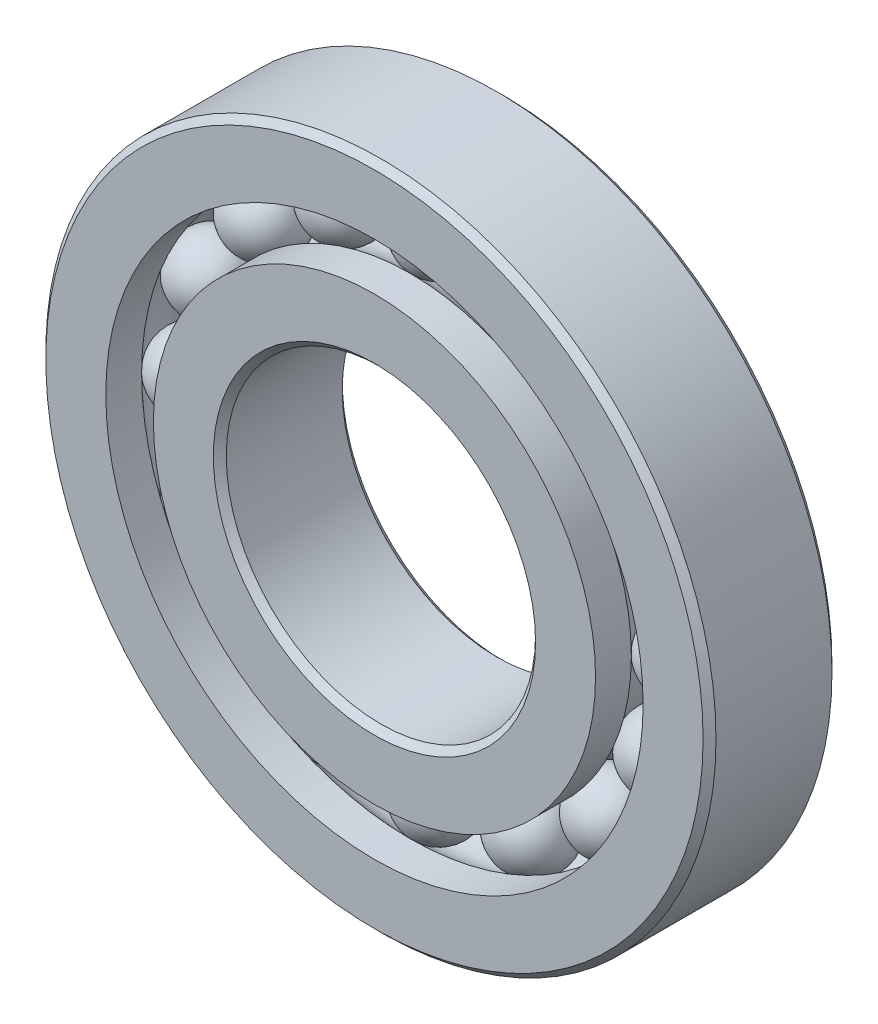
ISO-10303-21;
HEADER;
FILE_DESCRIPTION(('STEP AP214'),'2;1');
FILE_NAME('part.step','',(''),(''),'','','');
FILE_SCHEMA(('AUTOMOTIVE_DESIGN { 1 0 10303 214 1 1 1 1 }'));
ENDSEC;
DATA;
#1=APPLICATION_CONTEXT('core data for automotive mechanical design processes');
#2=APPLICATION_PROTOCOL_DEFINITION('international standard','automotive_design',2000,#1);
#3=PRODUCT_CONTEXT('',#1,'mechanical');
#4=PRODUCT('Part','Part','',(#3));
#5=PRODUCT_RELATED_PRODUCT_CATEGORY('part','',(#4));
#6=PRODUCT_DEFINITION_FORMATION('','',#4);
#7=PRODUCT_DEFINITION_CONTEXT('part definition',#1,'design');
#8=PRODUCT_DEFINITION('design','',#6,#7);
#9=PRODUCT_DEFINITION_SHAPE('','',#8);
#10=(LENGTH_UNIT() NAMED_UNIT(*) SI_UNIT(.MILLI.,.METRE.));
#11=(NAMED_UNIT(*) PLANE_ANGLE_UNIT() SI_UNIT($,.RADIAN.));
#12=(NAMED_UNIT(*) SI_UNIT($,.STERADIAN.) SOLID_ANGLE_UNIT());
#13=UNCERTAINTY_MEASURE_WITH_UNIT(LENGTH_MEASURE(1.E-05),#10,'distance_accuracy_value','');
#14=(GEOMETRIC_REPRESENTATION_CONTEXT(3) GLOBAL_UNCERTAINTY_ASSIGNED_CONTEXT((#13)) GLOBAL_UNIT_ASSIGNED_CONTEXT((#10,
#11,#12)) REPRESENTATION_CONTEXT('',''));
#15=CARTESIAN_POINT('',(0.,0.,0.));
#16=DIRECTION('',(0.,0.,1.));
#17=DIRECTION('',(1.,0.,0.));
#18=AXIS2_PLACEMENT_3D('',#15,#16,#17);
#19=CARTESIAN_POINT('',(-5.77134451435582,13.9332581996859,0.));
#20=DIRECTION('',(0.,0.,1.));
#21=DIRECTION('',(-0.382683432365077,0.923879532511292,0.));
#22=AXIS2_PLACEMENT_3D('',#19,#20,#21);
#23=SPHERICAL_SURFACE('',#22,2.29317598176668);
#24=CARTESIAN_POINT('',(-5.77134451435582,13.9332581996859,2.29317598176668));
#25=VERTEX_POINT('',#24);
#26=VERTEX_LOOP('',#25);
#27=FACE_BOUND('',#26,.T.);
#28=ADVANCED_FACE('F41',(#27),#23,.T.);
#29=CLOSED_SHELL('',(#28));
#30=MANIFOLD_SOLID_BREP('B2',#29);
#31=CARTESIAN_POINT('',(-10.6640541437695,10.6640541437698,0.));
#32=DIRECTION('',(0.,0.,1.));
#33=DIRECTION('',(-0.707106781186539,0.707106781186556,0.));
#34=AXIS2_PLACEMENT_3D('',#31,#32,#33);
#35=SPHERICAL_SURFACE('',#34,2.29317598176668);
#36=CARTESIAN_POINT('',(-10.6640541437695,10.6640541437698,2.29317598176668));
#37=VERTEX_POINT('',#36);
#38=VERTEX_LOOP('',#37);
#39=FACE_BOUND('',#38,.T.);
#40=ADVANCED_FACE('F74',(#39),#35,.T.);
#41=CLOSED_SHELL('',(#40));
#42=MANIFOLD_SOLID_BREP('B6',#41);
#43=CARTESIAN_POINT('',(-13.9332581996858,5.77134451435616,0.));
#44=DIRECTION('',(0.,0.,1.));
#45=DIRECTION('',(-0.923879532511283,0.3826834323651,0.));
#46=AXIS2_PLACEMENT_3D('',#43,#44,#45);
#47=SPHERICAL_SURFACE('',#46,2.29317598176668);
#48=CARTESIAN_POINT('',(-13.9332581996858,5.77134451435616,2.29317598176668));
#49=VERTEX_POINT('',#48);
#50=VERTEX_LOOP('',#49);
#51=FACE_BOUND('',#50,.T.);
#52=ADVANCED_FACE('F105',(#51),#47,.T.);
#53=CLOSED_SHELL('',(#52));
#54=MANIFOLD_SOLID_BREP('B37',#53);
#55=CARTESIAN_POINT('',(-15.08125,1.57967800319193E-13,0.));
#56=DIRECTION('',(0.,0.,1.));
#57=DIRECTION('',(-1.,0.,0.));
#58=AXIS2_PLACEMENT_3D('',#55,#56,#57);
#59=SPHERICAL_SURFACE('',#58,2.29317598176668);
#60=CARTESIAN_POINT('',(-15.08125,1.57967800319193E-13,2.29317598176668));
#61=VERTEX_POINT('',#60);
#62=VERTEX_LOOP('',#61);
#63=FACE_BOUND('',#62,.T.);
#64=ADVANCED_FACE('F138',(#63),#59,.T.);
#65=CLOSED_SHELL('',(#64));
#66=MANIFOLD_SOLID_BREP('B70',#65);
#67=CARTESIAN_POINT('',(-13.9332581996859,-5.77134451435587,0.));
#68=DIRECTION('',(0.,0.,1.));
#69=DIRECTION('',(-0.923879532511291,-0.382683432365081,0.));
#70=AXIS2_PLACEMENT_3D('',#67,#68,#69);
#71=SPHERICAL_SURFACE('',#70,2.29317598176668);
#72=CARTESIAN_POINT('',(-13.9332581996859,-5.77134451435587,2.29317598176668));
#73=VERTEX_POINT('',#72);
#74=VERTEX_LOOP('',#73);
#75=FACE_BOUND('',#74,.T.);
#76=ADVANCED_FACE('F171',(#75),#71,.T.);
#77=CLOSED_SHELL('',(#76));
#78=MANIFOLD_SOLID_BREP('B101',#77);
#79=CARTESIAN_POINT('',(-10.6640541437697,-10.6640541437695,0.));
#80=DIRECTION('',(0.,0.,1.));
#81=DIRECTION('',(-0.707106781186554,-0.707106781186541,0.));
#82=AXIS2_PLACEMENT_3D('',#79,#80,#81);
#83=SPHERICAL_SURFACE('',#82,2.29317598176668);
#84=CARTESIAN_POINT('',(-10.6640541437697,-10.6640541437695,2.29317598176668));
#85=VERTEX_POINT('',#84);
#86=VERTEX_LOOP('',#85);
#87=FACE_BOUND('',#86,.T.);
#88=ADVANCED_FACE('F205',(#87),#83,.T.);
#89=CLOSED_SHELL('',(#88));
#90=MANIFOLD_SOLID_BREP('B134',#89);
#91=CARTESIAN_POINT('',(-5.77134451435612,-13.9332581996858,0.));
#92=DIRECTION('',(0.,0.,1.));
#93=DIRECTION('',(-0.382683432365097,-0.923879532511284,0.));
#94=AXIS2_PLACEMENT_3D('',#91,#92,#93);
#95=SPHERICAL_SURFACE('',#94,2.29317598176668);
#96=CARTESIAN_POINT('',(-5.77134451435612,-13.9332581996858,2.29317598176668));
#97=VERTEX_POINT('',#96);
#98=VERTEX_LOOP('',#97);
#99=FACE_BOUND('',#98,.T.);
#100=ADVANCED_FACE('F239',(#99),#95,.T.);
#101=CLOSED_SHELL('',(#100));
#102=MANIFOLD_SOLID_BREP('B167',#101);
#103=CARTESIAN_POINT('',(-1.05311866879462E-13,-15.08125,0.));
#104=DIRECTION('',(0.,0.,1.));
#105=DIRECTION('',(0.,-1.,0.));
#106=AXIS2_PLACEMENT_3D('',#103,#104,#105);
#107=SPHERICAL_SURFACE('',#106,2.29317598176668);
#108=CARTESIAN_POINT('',(-1.05311866879462E-13,-15.08125,2.29317598176668));
#109=VERTEX_POINT('',#108);
#110=VERTEX_LOOP('',#109);
#111=FACE_BOUND('',#110,.T.);
#112=ADVANCED_FACE('F273',(#111),#107,.T.);
#113=CLOSED_SHELL('',(#112));
#114=MANIFOLD_SOLID_BREP('B201',#113);
#115=CARTESIAN_POINT('',(5.77134451435592,-13.9332581996859,0.));
#116=DIRECTION('',(0.,0.,1.));
#117=DIRECTION('',(0.382683432365084,-0.923879532511289,0.));
#118=AXIS2_PLACEMENT_3D('',#115,#116,#117);
#119=SPHERICAL_SURFACE('',#118,2.29317598176668);
#120=CARTESIAN_POINT('',(5.77134451435592,-13.9332581996859,2.29317598176668));
#121=VERTEX_POINT('',#120);
#122=VERTEX_LOOP('',#121);
#123=FACE_BOUND('',#122,.T.);
#124=ADVANCED_FACE('F307',(#123),#119,.T.);
#125=CLOSED_SHELL('',(#124));
#126=MANIFOLD_SOLID_BREP('B235',#125);
#127=CARTESIAN_POINT('',(10.6640541437696,-10.6640541437697,0.));
#128=DIRECTION('',(0.,0.,1.));
#129=DIRECTION('',(0.707106781186544,-0.707106781186551,0.));
#130=AXIS2_PLACEMENT_3D('',#127,#128,#129);
#131=SPHERICAL_SURFACE('',#130,2.29317598176668);
#132=CARTESIAN_POINT('',(10.6640541437696,-10.6640541437697,2.29317598176668));
#133=VERTEX_POINT('',#132);
#134=VERTEX_LOOP('',#133);
#135=FACE_BOUND('',#134,.T.);
#136=ADVANCED_FACE('F341',(#135),#131,.T.);
#137=CLOSED_SHELL('',(#136));
#138=MANIFOLD_SOLID_BREP('B269',#137);
#139=CARTESIAN_POINT('',(13.9332581996858,-5.77134451435607,0.));
#140=DIRECTION('',(0.,0.,1.));
#141=DIRECTION('',(0.923879532511285,-0.382683432365094,0.));
#142=AXIS2_PLACEMENT_3D('',#139,#140,#141);
#143=SPHERICAL_SURFACE('',#142,2.29317598176668);
#144=CARTESIAN_POINT('',(13.9332581996858,-5.77134451435607,2.29317598176668));
#145=VERTEX_POINT('',#144);
#146=VERTEX_LOOP('',#145);
#147=FACE_BOUND('',#146,.T.);
#148=ADVANCED_FACE('F375',(#147),#143,.T.);
#149=CLOSED_SHELL('',(#148));
#150=MANIFOLD_SOLID_BREP('B303',#149);
#151=CARTESIAN_POINT('',(15.08125,0.,0.));
#152=DIRECTION('',(0.,0.,1.));
#153=DIRECTION('',(1.,0.,0.));
#154=AXIS2_PLACEMENT_3D('',#151,#152,#153);
#155=SPHERICAL_SURFACE('',#154,2.29317598176668);
#156=CARTESIAN_POINT('',(15.08125,0.,2.29317598176668));
#157=VERTEX_POINT('',#156);
#158=VERTEX_LOOP('',#157);
#159=FACE_BOUND('',#158,.T.);
#160=ADVANCED_FACE('F409',(#159),#155,.T.);
#161=CLOSED_SHELL('',(#160));
#162=MANIFOLD_SOLID_BREP('B337',#161);
#163=CARTESIAN_POINT('',(13.9332581996859,5.77134451435597,0.));
#164=DIRECTION('',(0.,0.,1.));
#165=DIRECTION('',(0.923879532511288,0.382683432365087,0.));
#166=AXIS2_PLACEMENT_3D('',#163,#164,#165);
#167=SPHERICAL_SURFACE('',#166,2.29317598176668);
#168=CARTESIAN_POINT('',(13.9332581996859,5.77134451435597,2.29317598176668));
#169=VERTEX_POINT('',#168);
#170=VERTEX_LOOP('',#169);
#171=FACE_BOUND('',#170,.T.);
#172=ADVANCED_FACE('F443',(#171),#167,.T.);
#173=CLOSED_SHELL('',(#172));
#174=MANIFOLD_SOLID_BREP('B371',#173);
#175=CARTESIAN_POINT('',(10.6640541437696,10.6640541437696,0.));
#176=DIRECTION('',(0.,0.,1.));
#177=DIRECTION('',(0.707106781186549,0.707106781186546,0.));
#178=AXIS2_PLACEMENT_3D('',#175,#176,#177);
#179=SPHERICAL_SURFACE('',#178,2.29317598176668);
#180=CARTESIAN_POINT('',(10.6640541437696,10.6640541437696,2.29317598176668));
#181=VERTEX_POINT('',#180);
#182=VERTEX_LOOP('',#181);
#183=FACE_BOUND('',#182,.T.);
#184=ADVANCED_FACE('F476',(#183),#179,.T.);
#185=CLOSED_SHELL('',(#184));
#186=MANIFOLD_SOLID_BREP('B405',#185);
#187=CARTESIAN_POINT('',(5.77134451435602,13.9332581996858,0.));
#188=DIRECTION('',(0.,0.,1.));
#189=DIRECTION('',(0.382683432365091,0.923879532511287,0.));
#190=AXIS2_PLACEMENT_3D('',#187,#188,#189);
#191=SPHERICAL_SURFACE('',#190,2.29317598176668);
#192=CARTESIAN_POINT('',(5.77134451435602,13.9332581996858,2.29317598176668));
#193=VERTEX_POINT('',#192);
#194=VERTEX_LOOP('',#193);
#195=FACE_BOUND('',#194,.T.);
#196=ADVANCED_FACE('F509',(#195),#191,.T.);
#197=CLOSED_SHELL('',(#196));
#198=MANIFOLD_SOLID_BREP('B439',#197);
#199=CARTESIAN_POINT('',(0.,15.08125,0.));
#200=DIRECTION('',(0.,0.,1.));
#201=DIRECTION('',(0.,1.,0.));
#202=AXIS2_PLACEMENT_3D('',#199,#200,#201);
#203=SPHERICAL_SURFACE('',#202,2.29317598176668);
#204=CARTESIAN_POINT('',(0.,15.08125,2.29317598176668));
#205=VERTEX_POINT('',#204);
#206=VERTEX_LOOP('',#205);
#207=FACE_BOUND('',#206,.T.);
#208=ADVANCED_FACE('F544',(#207),#203,.T.);
#209=CLOSED_SHELL('',(#208));
#210=MANIFOLD_SOLID_BREP('B472',#209);
#211=CARTESIAN_POINT('',(0.,13.6158653846154,3.96875));
#212=DIRECTION('',(0.,0.,-1.));
#213=DIRECTION('',(-1.,0.,0.));
#214=AXIS2_PLACEMENT_3D('',#211,#212,#213);
#215=PLANE('',#214);
#216=CARTESIAN_POINT('',(0.,0.,3.96875));
#217=DIRECTION('',(0.,0.,1.));
#218=DIRECTION('',(1.,0.,0.));
#219=AXIS2_PLACEMENT_3D('',#216,#217,#218);
#220=CIRCLE('',#219,9.921875);
#221=CARTESIAN_POINT('',(9.921875,0.,3.96875));
#222=VERTEX_POINT('',#221);
#223=EDGE_CURVE('E591',#222,#222,#220,.T.);
#224=ORIENTED_EDGE('',*,*,#223,.F.);
#225=EDGE_LOOP('',(#224));
#226=FACE_BOUND('',#225,.T.);
#227=CARTESIAN_POINT('',(0.,0.,3.96875));
#228=DIRECTION('',(0.,0.,1.));
#229=DIRECTION('',(1.,0.,0.));
#230=AXIS2_PLACEMENT_3D('',#227,#228,#229);
#231=CIRCLE('',#230,13.6158653846154);
#232=CARTESIAN_POINT('',(13.6158653846154,0.,3.96875));
#233=VERTEX_POINT('',#232);
#234=EDGE_CURVE('E543',#233,#233,#231,.T.);
#235=ORIENTED_EDGE('',*,*,#234,.T.);
#236=EDGE_LOOP('',(#235));
#237=FACE_BOUND('',#236,.T.);
#238=ADVANCED_FACE('F563',(#226,#237),#215,.F.);
#239=CARTESIAN_POINT('',(0.,0.,3.96875));
#240=DIRECTION('',(0.,0.,1.));
#241=DIRECTION('',(1.,0.,0.));
#242=AXIS2_PLACEMENT_3D('',#239,#240,#241);
#243=CYLINDRICAL_SURFACE('',#242,13.6158653846154);
#244=ORIENTED_EDGE('',*,*,#234,.F.);
#245=EDGE_LOOP('',(#244));
#246=FACE_BOUND('',#245,.T.);
#247=CARTESIAN_POINT('',(0.,0.,1.76388888888889));
#248=DIRECTION('',(0.,0.,1.));
#249=DIRECTION('',(1.,0.,0.));
#250=AXIS2_PLACEMENT_3D('',#247,#248,#249);
#251=CIRCLE('',#250,13.6158653846154);
#252=CARTESIAN_POINT('',(13.6158653846154,0.,1.76388888888889));
#253=VERTEX_POINT('',#252);
#254=EDGE_CURVE('E569',#253,#253,#251,.T.);
#255=ORIENTED_EDGE('',*,*,#254,.T.);
#256=EDGE_LOOP('',(#255));
#257=FACE_BOUND('',#256,.T.);
#258=ADVANCED_FACE('F598',(#246,#257),#243,.T.);
#259=CARTESIAN_POINT('',(0.,0.,0.));
#260=DIRECTION('',(0.,0.,1.));
#261=DIRECTION('',(1.,0.,0.));
#262=AXIS2_PLACEMENT_3D('',#259,#260,#261);
#263=TOROIDAL_SURFACE('',#262,15.08125,2.29317598176668);
#264=ORIENTED_EDGE('',*,*,#254,.F.);
#265=EDGE_LOOP('',(#264));
#266=FACE_BOUND('',#265,.T.);
#267=CARTESIAN_POINT('',(0.,0.,-1.76388888888889));
#268=DIRECTION('',(0.,0.,1.));
#269=DIRECTION('',(1.,0.,0.));
#270=AXIS2_PLACEMENT_3D('',#267,#268,#269);
#271=CIRCLE('',#270,13.6158653846154);
#272=CARTESIAN_POINT('',(13.6158653846154,0.,-1.76388888888889));
#273=VERTEX_POINT('',#272);
#274=EDGE_CURVE('E573',#273,#273,#271,.T.);
#275=ORIENTED_EDGE('',*,*,#274,.T.);
#276=EDGE_LOOP('',(#275));
#277=FACE_BOUND('',#276,.T.);
#278=ADVANCED_FACE('F602',(#266,#277),#263,.F.);
#279=CARTESIAN_POINT('',(0.,0.,3.96875));
#280=DIRECTION('',(0.,0.,1.));
#281=DIRECTION('',(1.,0.,0.));
#282=AXIS2_PLACEMENT_3D('',#279,#280,#281);
#283=CYLINDRICAL_SURFACE('',#282,13.6158653846154);
#284=ORIENTED_EDGE('',*,*,#274,.F.);
#285=EDGE_LOOP('',(#284));
#286=FACE_BOUND('',#285,.T.);
#287=CARTESIAN_POINT('',(0.,0.,-3.96875));
#288=DIRECTION('',(0.,0.,1.));
#289=DIRECTION('',(1.,0.,0.));
#290=AXIS2_PLACEMENT_3D('',#287,#288,#289);
#291=CIRCLE('',#290,13.6158653846154);
#292=CARTESIAN_POINT('',(13.6158653846154,0.,-3.96875));
#293=VERTEX_POINT('',#292);
#294=EDGE_CURVE('E577',#293,#293,#291,.T.);
#295=ORIENTED_EDGE('',*,*,#294,.T.);
#296=EDGE_LOOP('',(#295));
#297=FACE_BOUND('',#296,.T.);
#298=ADVANCED_FACE('F607',(#286,#297),#283,.T.);
#299=CARTESIAN_POINT('',(0.,9.921875,-3.96875));
#300=DIRECTION('',(0.,0.,1.));
#301=DIRECTION('',(1.,0.,0.));
#302=AXIS2_PLACEMENT_3D('',#299,#300,#301);
#303=PLANE('',#302);
#304=ORIENTED_EDGE('',*,*,#294,.F.);
#305=EDGE_LOOP('',(#304));
#306=FACE_BOUND('',#305,.T.);
#307=CARTESIAN_POINT('',(0.,0.,-3.96875));
#308=DIRECTION('',(0.,0.,1.));
#309=DIRECTION('',(1.,0.,0.));
#310=AXIS2_PLACEMENT_3D('',#307,#308,#309);
#311=CIRCLE('',#310,9.921875);
#312=CARTESIAN_POINT('',(9.921875,0.,-3.96875));
#313=VERTEX_POINT('',#312);
#314=EDGE_CURVE('E582',#313,#313,#311,.T.);
#315=ORIENTED_EDGE('',*,*,#314,.T.);
#316=EDGE_LOOP('',(#315));
#317=FACE_BOUND('',#316,.T.);
#318=ADVANCED_FACE('F613',(#306,#317),#303,.F.);
#319=CARTESIAN_POINT('',(0.,0.,-3.571875));
#320=DIRECTION('',(0.,0.,-1.));
#321=DIRECTION('',(-1.,0.,0.));
#322=AXIS2_PLACEMENT_3D('',#319,#320,#321);
#323=CONICAL_SURFACE('',#322,9.525,0.785398163397446);
#324=ORIENTED_EDGE('',*,*,#314,.F.);
#325=EDGE_LOOP('',(#324));
#326=FACE_BOUND('',#325,.T.);
#327=CARTESIAN_POINT('',(0.,0.,-3.571875));
#328=DIRECTION('',(0.,0.,1.));
#329=DIRECTION('',(1.,0.,0.));
#330=AXIS2_PLACEMENT_3D('',#327,#328,#329);
#331=CIRCLE('',#330,9.525);
#332=CARTESIAN_POINT('',(9.525,0.,-3.571875));
#333=VERTEX_POINT('',#332);
#334=EDGE_CURVE('E585',#333,#333,#331,.T.);
#335=ORIENTED_EDGE('',*,*,#334,.T.);
#336=EDGE_LOOP('',(#335));
#337=FACE_BOUND('',#336,.T.);
#338=ADVANCED_FACE('F617',(#326,#337),#323,.F.);
#339=CARTESIAN_POINT('',(0.,0.,3.96875));
#340=DIRECTION('',(0.,0.,1.));
#341=DIRECTION('',(1.,0.,0.));
#342=AXIS2_PLACEMENT_3D('',#339,#340,#341);
#343=CYLINDRICAL_SURFACE('',#342,9.525);
#344=ORIENTED_EDGE('',*,*,#334,.F.);
#345=EDGE_LOOP('',(#344));
#346=FACE_BOUND('',#345,.T.);
#347=CARTESIAN_POINT('',(0.,0.,3.57187500000001));
#348=DIRECTION('',(0.,0.,1.));
#349=DIRECTION('',(1.,0.,0.));
#350=AXIS2_PLACEMENT_3D('',#347,#348,#349);
#351=CIRCLE('',#350,9.525);
#352=CARTESIAN_POINT('',(9.525,0.,3.57187500000001));
#353=VERTEX_POINT('',#352);
#354=EDGE_CURVE('E588',#353,#353,#351,.T.);
#355=ORIENTED_EDGE('',*,*,#354,.T.);
#356=EDGE_LOOP('',(#355));
#357=FACE_BOUND('',#356,.T.);
#358=ADVANCED_FACE('F621',(#346,#357),#343,.F.);
#359=CARTESIAN_POINT('',(0.,0.,3.96875));
#360=DIRECTION('',(0.,0.,1.));
#361=DIRECTION('',(1.,0.,0.));
#362=AXIS2_PLACEMENT_3D('',#359,#360,#361);
#363=CONICAL_SURFACE('',#362,9.921875,0.78539816339745);
#364=ORIENTED_EDGE('',*,*,#354,.F.);
#365=EDGE_LOOP('',(#364));
#366=FACE_BOUND('',#365,.T.);
#367=ORIENTED_EDGE('',*,*,#223,.T.);
#368=EDGE_LOOP('',(#367));
#369=FACE_BOUND('',#368,.T.);
#370=ADVANCED_FACE('F595',(#366,#369),#363,.F.);
#371=CLOSED_SHELL('',(#238,#258,#278,#298,#318,#338,#358,#370));
#372=MANIFOLD_SOLID_BREP('B505',#371);
#373=CARTESIAN_POINT('',(0.,0.,3.571875));
#374=DIRECTION('',(0.,0.,-1.));
#375=DIRECTION('',(-1.,0.,0.));
#376=AXIS2_PLACEMENT_3D('',#373,#374,#375);
#377=CONICAL_SURFACE('',#376,20.6375,0.785398163397447);
#378=CARTESIAN_POINT('',(0.,0.,3.96875));
#379=DIRECTION('',(0.,0.,1.));
#380=DIRECTION('',(1.,0.,0.));
#381=AXIS2_PLACEMENT_3D('',#378,#379,#380);
#382=CIRCLE('',#381,20.240625);
#383=CARTESIAN_POINT('',(20.240625,0.,3.96875));
#384=VERTEX_POINT('',#383);
#385=EDGE_CURVE('E712',#384,#384,#382,.T.);
#386=ORIENTED_EDGE('',*,*,#385,.F.);
#387=EDGE_LOOP('',(#386));
#388=FACE_BOUND('',#387,.T.);
#389=CARTESIAN_POINT('',(0.,0.,3.571875));
#390=DIRECTION('',(0.,0.,1.));
#391=DIRECTION('',(1.,0.,0.));
#392=AXIS2_PLACEMENT_3D('',#389,#390,#391);
#393=CIRCLE('',#392,20.6375);
#394=CARTESIAN_POINT('',(20.6375,0.,3.571875));
#395=VERTEX_POINT('',#394);
#396=EDGE_CURVE('E562',#395,#395,#393,.T.);
#397=ORIENTED_EDGE('',*,*,#396,.T.);
#398=EDGE_LOOP('',(#397));
#399=FACE_BOUND('',#398,.T.);
#400=ADVANCED_FACE('F684',(#388,#399),#377,.T.);
#401=CARTESIAN_POINT('',(0.,0.,3.96875));
#402=DIRECTION('',(0.,0.,1.));
#403=DIRECTION('',(1.,0.,0.));
#404=AXIS2_PLACEMENT_3D('',#401,#402,#403);
#405=CYLINDRICAL_SURFACE('',#404,20.6375);
#406=ORIENTED_EDGE('',*,*,#396,.F.);
#407=EDGE_LOOP('',(#406));
#408=FACE_BOUND('',#407,.T.);
#409=CARTESIAN_POINT('',(0.,0.,-3.571875));
#410=DIRECTION('',(0.,0.,1.));
#411=DIRECTION('',(1.,0.,0.));
#412=AXIS2_PLACEMENT_3D('',#409,#410,#411);
#413=CIRCLE('',#412,20.6375);
#414=CARTESIAN_POINT('',(20.6375,0.,-3.571875));
#415=VERTEX_POINT('',#414);
#416=EDGE_CURVE('E690',#415,#415,#413,.T.);
#417=ORIENTED_EDGE('',*,*,#416,.T.);
#418=EDGE_LOOP('',(#417));
#419=FACE_BOUND('',#418,.T.);
#420=ADVANCED_FACE('F719',(#408,#419),#405,.T.);
#421=CARTESIAN_POINT('',(0.,0.,-3.96875));
#422=DIRECTION('',(0.,0.,1.));
#423=DIRECTION('',(1.,0.,0.));
#424=AXIS2_PLACEMENT_3D('',#421,#422,#423);
#425=CONICAL_SURFACE('',#424,20.240625,0.785398163397446);
#426=ORIENTED_EDGE('',*,*,#416,.F.);
#427=EDGE_LOOP('',(#426));
#428=FACE_BOUND('',#427,.T.);
#429=CARTESIAN_POINT('',(0.,0.,-3.96875));
#430=DIRECTION('',(0.,0.,1.));
#431=DIRECTION('',(1.,0.,0.));
#432=AXIS2_PLACEMENT_3D('',#429,#430,#431);
#433=CIRCLE('',#432,20.240625);
#434=CARTESIAN_POINT('',(20.240625,0.,-3.96875));
#435=VERTEX_POINT('',#434);
#436=EDGE_CURVE('E694',#435,#435,#433,.T.);
#437=ORIENTED_EDGE('',*,*,#436,.T.);
#438=EDGE_LOOP('',(#437));
#439=FACE_BOUND('',#438,.T.);
#440=ADVANCED_FACE('F723',(#428,#439),#425,.T.);
#441=CARTESIAN_POINT('',(0.,20.240625,-3.96875));
#442=DIRECTION('',(0.,0.,1.));
#443=DIRECTION('',(1.,0.,0.));
#444=AXIS2_PLACEMENT_3D('',#441,#442,#443);
#445=PLANE('',#444);
#446=ORIENTED_EDGE('',*,*,#436,.F.);
#447=EDGE_LOOP('',(#446));
#448=FACE_BOUND('',#447,.T.);
#449=CARTESIAN_POINT('',(0.,0.,-3.96875));
#450=DIRECTION('',(0.,0.,1.));
#451=DIRECTION('',(1.,0.,0.));
#452=AXIS2_PLACEMENT_3D('',#449,#450,#451);
#453=CIRCLE('',#452,16.5466346153846);
#454=CARTESIAN_POINT('',(16.5466346153846,0.,-3.96875));
#455=VERTEX_POINT('',#454);
#456=EDGE_CURVE('E698',#455,#455,#453,.T.);
#457=ORIENTED_EDGE('',*,*,#456,.T.);
#458=EDGE_LOOP('',(#457));
#459=FACE_BOUND('',#458,.T.);
#460=ADVANCED_FACE('F728',(#448,#459),#445,.F.);
#461=CARTESIAN_POINT('',(0.,0.,3.96875));
#462=DIRECTION('',(0.,0.,1.));
#463=DIRECTION('',(1.,0.,0.));
#464=AXIS2_PLACEMENT_3D('',#461,#462,#463);
#465=CYLINDRICAL_SURFACE('',#464,16.5466346153846);
#466=ORIENTED_EDGE('',*,*,#456,.F.);
#467=EDGE_LOOP('',(#466));
#468=FACE_BOUND('',#467,.T.);
#469=CARTESIAN_POINT('',(0.,0.,-1.76388888888889));
#470=DIRECTION('',(0.,0.,1.));
#471=DIRECTION('',(1.,0.,0.));
#472=AXIS2_PLACEMENT_3D('',#469,#470,#471);
#473=CIRCLE('',#472,16.5466346153846);
#474=CARTESIAN_POINT('',(16.5466346153846,0.,-1.76388888888889));
#475=VERTEX_POINT('',#474);
#476=EDGE_CURVE('E703',#475,#475,#473,.T.);
#477=ORIENTED_EDGE('',*,*,#476,.T.);
#478=EDGE_LOOP('',(#477));
#479=FACE_BOUND('',#478,.T.);
#480=ADVANCED_FACE('F734',(#468,#479),#465,.F.);
#481=CARTESIAN_POINT('',(0.,0.,0.));
#482=DIRECTION('',(0.,0.,1.));
#483=DIRECTION('',(1.,0.,0.));
#484=AXIS2_PLACEMENT_3D('',#481,#482,#483);
#485=TOROIDAL_SURFACE('',#484,15.08125,2.29317598176668);
#486=ORIENTED_EDGE('',*,*,#476,.F.);
#487=EDGE_LOOP('',(#486));
#488=FACE_BOUND('',#487,.T.);
#489=CARTESIAN_POINT('',(0.,0.,1.76388888888889));
#490=DIRECTION('',(0.,0.,1.));
#491=DIRECTION('',(1.,0.,0.));
#492=AXIS2_PLACEMENT_3D('',#489,#490,#491);
#493=CIRCLE('',#492,16.5466346153846);
#494=CARTESIAN_POINT('',(16.5466346153846,0.,1.76388888888889));
#495=VERTEX_POINT('',#494);
#496=EDGE_CURVE('E706',#495,#495,#493,.T.);
#497=ORIENTED_EDGE('',*,*,#496,.T.);
#498=EDGE_LOOP('',(#497));
#499=FACE_BOUND('',#498,.T.);
#500=ADVANCED_FACE('F738',(#488,#499),#485,.F.);
#501=CARTESIAN_POINT('',(0.,0.,3.96875));
#502=DIRECTION('',(0.,0.,1.));
#503=DIRECTION('',(1.,0.,0.));
#504=AXIS2_PLACEMENT_3D('',#501,#502,#503);
#505=CYLINDRICAL_SURFACE('',#504,16.5466346153846);
#506=ORIENTED_EDGE('',*,*,#496,.F.);
#507=EDGE_LOOP('',(#506));
#508=FACE_BOUND('',#507,.T.);
#509=CARTESIAN_POINT('',(0.,0.,3.96875));
#510=DIRECTION('',(0.,0.,1.));
#511=DIRECTION('',(1.,0.,0.));
#512=AXIS2_PLACEMENT_3D('',#509,#510,#511);
#513=CIRCLE('',#512,16.5466346153846);
#514=CARTESIAN_POINT('',(16.5466346153846,0.,3.96875));
#515=VERTEX_POINT('',#514);
#516=EDGE_CURVE('E709',#515,#515,#513,.T.);
#517=ORIENTED_EDGE('',*,*,#516,.T.);
#518=EDGE_LOOP('',(#517));
#519=FACE_BOUND('',#518,.T.);
#520=ADVANCED_FACE('F742',(#508,#519),#505,.F.);
#521=CARTESIAN_POINT('',(0.,20.240625,3.96875));
#522=DIRECTION('',(0.,0.,-1.));
#523=DIRECTION('',(-1.,0.,0.));
#524=AXIS2_PLACEMENT_3D('',#521,#522,#523);
#525=PLANE('',#524);
#526=ORIENTED_EDGE('',*,*,#516,.F.);
#527=EDGE_LOOP('',(#526));
#528=FACE_BOUND('',#527,.T.);
#529=ORIENTED_EDGE('',*,*,#385,.T.);
#530=EDGE_LOOP('',(#529));
#531=FACE_BOUND('',#530,.T.);
#532=ADVANCED_FACE('F716',(#528,#531),#525,.F.);
#533=CLOSED_SHELL('',(#400,#420,#440,#460,#480,#500,#520,#532));
#534=MANIFOLD_SOLID_BREP('B538',#533);
#535=ADVANCED_BREP_SHAPE_REPRESENTATION('',(#18,#30,#42,#54,#66,#78,#90,#102,#114,#126,#138,
#150,#162,#174,#186,#198,#210,#372,#534),#14);
#536=SHAPE_DEFINITION_REPRESENTATION(#9,#535);
ENDSEC;
END-ISO-10303-21;
